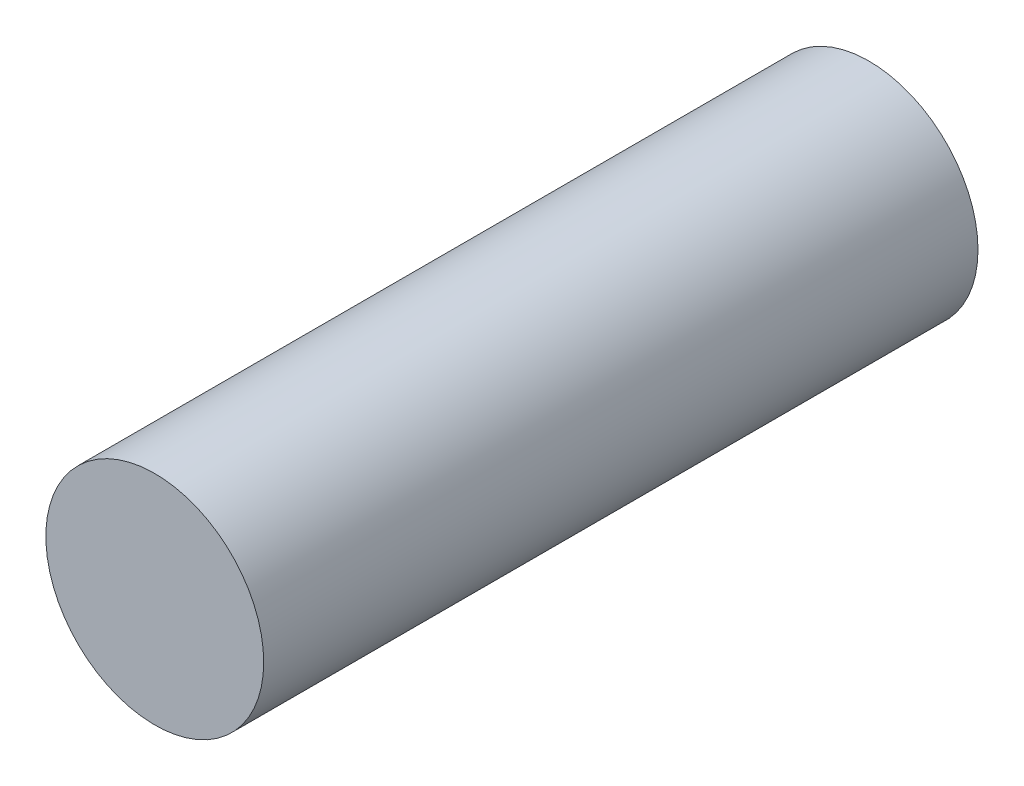
ISO-10303-21;
HEADER;
FILE_DESCRIPTION(('STEP AP214'),'2;1');
FILE_NAME('part.step','',(''),(''),'','','');
FILE_SCHEMA(('AUTOMOTIVE_DESIGN { 1 0 10303 214 1 1 1 1 }'));
ENDSEC;
DATA;
#1=APPLICATION_CONTEXT('core data for automotive mechanical design processes');
#2=APPLICATION_PROTOCOL_DEFINITION('international standard','automotive_design',2000,#1);
#3=PRODUCT_CONTEXT('',#1,'mechanical');
#4=PRODUCT('Part','Part','',(#3));
#5=PRODUCT_RELATED_PRODUCT_CATEGORY('part','',(#4));
#6=PRODUCT_DEFINITION_FORMATION('','',#4);
#7=PRODUCT_DEFINITION_CONTEXT('part definition',#1,'design');
#8=PRODUCT_DEFINITION('design','',#6,#7);
#9=PRODUCT_DEFINITION_SHAPE('','',#8);
#10=(LENGTH_UNIT() NAMED_UNIT(*) SI_UNIT(.MILLI.,.METRE.));
#11=(NAMED_UNIT(*) PLANE_ANGLE_UNIT() SI_UNIT($,.RADIAN.));
#12=(NAMED_UNIT(*) SI_UNIT($,.STERADIAN.) SOLID_ANGLE_UNIT());
#13=UNCERTAINTY_MEASURE_WITH_UNIT(LENGTH_MEASURE(1.E-05),#10,'distance_accuracy_value','');
#14=(GEOMETRIC_REPRESENTATION_CONTEXT(3) GLOBAL_UNCERTAINTY_ASSIGNED_CONTEXT((#13)) GLOBAL_UNIT_ASSIGNED_CONTEXT((#10,
#11,#12)) REPRESENTATION_CONTEXT('',''));
#15=CARTESIAN_POINT('',(0.,0.,0.));
#16=DIRECTION('',(0.,0.,1.));
#17=DIRECTION('',(1.,0.,0.));
#18=AXIS2_PLACEMENT_3D('',#15,#16,#17);
#19=CARTESIAN_POINT('',(0.,0.,-17.));
#20=DIRECTION('',(0.,0.,1.));
#21=DIRECTION('',(1.,0.,0.));
#22=AXIS2_PLACEMENT_3D('',#19,#20,#21);
#23=CYLINDRICAL_SURFACE('',#22,3.05);
#24=CARTESIAN_POINT('',(0.,0.,-17.));
#25=DIRECTION('',(0.,0.,1.));
#26=DIRECTION('',(1.,0.,0.));
#27=AXIS2_PLACEMENT_3D('',#24,#25,#26);
#28=CIRCLE('',#27,3.05);
#29=CARTESIAN_POINT('',(3.05,0.,-17.));
#30=VERTEX_POINT('',#29);
#31=EDGE_CURVE('E10',#30,#30,#28,.T.);
#32=ORIENTED_EDGE('',*,*,#31,.T.);
#33=EDGE_LOOP('',(#32));
#34=FACE_BOUND('',#33,.T.);
#35=CARTESIAN_POINT('',(0.,0.,3.));
#36=DIRECTION('',(0.,0.,1.));
#37=DIRECTION('',(1.,0.,0.));
#38=AXIS2_PLACEMENT_3D('',#35,#36,#37);
#39=CIRCLE('',#38,3.05);
#40=CARTESIAN_POINT('',(3.05,0.,3.));
#41=VERTEX_POINT('',#40);
#42=EDGE_CURVE('E46',#41,#41,#39,.T.);
#43=ORIENTED_EDGE('',*,*,#42,.F.);
#44=EDGE_LOOP('',(#43));
#45=FACE_BOUND('',#44,.T.);
#46=ADVANCED_FACE('F39',(#34,#45),#23,.T.);
#47=CARTESIAN_POINT('',(0.,0.,-17.));
#48=DIRECTION('',(0.,0.,1.));
#49=DIRECTION('',(1.,0.,0.));
#50=AXIS2_PLACEMENT_3D('',#47,#48,#49);
#51=PLANE('',#50);
#52=ORIENTED_EDGE('',*,*,#31,.F.);
#53=EDGE_LOOP('',(#52));
#54=FACE_BOUND('',#53,.T.);
#55=ADVANCED_FACE('F56',(#54),#51,.F.);
#56=CARTESIAN_POINT('',(0.,0.,3.));
#57=DIRECTION('',(0.,0.,1.));
#58=DIRECTION('',(1.,0.,0.));
#59=AXIS2_PLACEMENT_3D('',#56,#57,#58);
#60=PLANE('',#59);
#61=ORIENTED_EDGE('',*,*,#42,.T.);
#62=EDGE_LOOP('',(#61));
#63=FACE_BOUND('',#62,.T.);
#64=ADVANCED_FACE('F53',(#63),#60,.T.);
#65=CLOSED_SHELL('',(#46,#55,#64));
#66=MANIFOLD_SOLID_BREP('B2',#65);
#67=ADVANCED_BREP_SHAPE_REPRESENTATION('',(#18,#66),#14);
#68=SHAPE_DEFINITION_REPRESENTATION(#9,#67);
ENDSEC;
END-ISO-10303-21;
